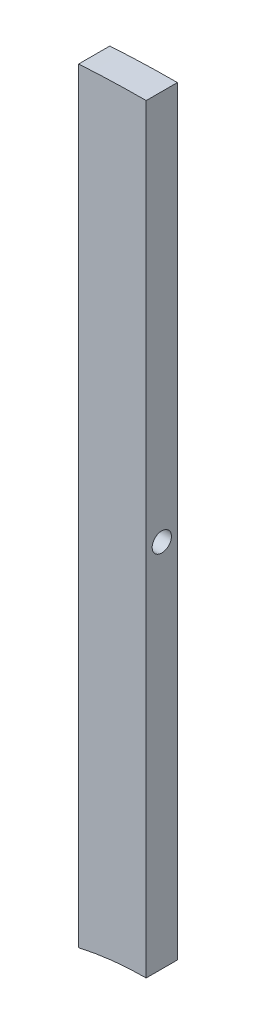
ISO-10303-21;
HEADER;
FILE_DESCRIPTION(('STEP AP214'),'2;1');
FILE_NAME('part.step','',(''),(''),'','','');
FILE_SCHEMA(('AUTOMOTIVE_DESIGN { 1 0 10303 214 1 1 1 1 }'));
ENDSEC;
DATA;
#1=APPLICATION_CONTEXT('core data for automotive mechanical design processes');
#2=APPLICATION_PROTOCOL_DEFINITION('international standard','automotive_design',2000,#1);
#3=PRODUCT_CONTEXT('',#1,'mechanical');
#4=PRODUCT('Part','Part','',(#3));
#5=PRODUCT_RELATED_PRODUCT_CATEGORY('part','',(#4));
#6=PRODUCT_DEFINITION_FORMATION('','',#4);
#7=PRODUCT_DEFINITION_CONTEXT('part definition',#1,'design');
#8=PRODUCT_DEFINITION('design','',#6,#7);
#9=PRODUCT_DEFINITION_SHAPE('','',#8);
#10=(LENGTH_UNIT() NAMED_UNIT(*) SI_UNIT(.MILLI.,.METRE.));
#11=(NAMED_UNIT(*) PLANE_ANGLE_UNIT() SI_UNIT($,.RADIAN.));
#12=(NAMED_UNIT(*) SI_UNIT($,.STERADIAN.) SOLID_ANGLE_UNIT());
#13=UNCERTAINTY_MEASURE_WITH_UNIT(LENGTH_MEASURE(1.E-05),#10,'distance_accuracy_value','');
#14=(GEOMETRIC_REPRESENTATION_CONTEXT(3) GLOBAL_UNCERTAINTY_ASSIGNED_CONTEXT((#13)) GLOBAL_UNIT_ASSIGNED_CONTEXT((#10,
#11,#12)) REPRESENTATION_CONTEXT('',''));
#15=CARTESIAN_POINT('',(0.,0.,0.));
#16=DIRECTION('',(0.,0.,1.));
#17=DIRECTION('',(1.,0.,0.));
#18=AXIS2_PLACEMENT_3D('',#15,#16,#17);
#19=CARTESIAN_POINT('',(0.,2.5,2.30625));
#20=DIRECTION('',(-1.,0.,0.));
#21=DIRECTION('',(0.,0.,1.));
#22=AXIS2_PLACEMENT_3D('',#19,#20,#21);
#23=PLANE('',#22);
#24=CARTESIAN_POINT('',(0.,0.,0.));
#25=DIRECTION('',(1.,0.,0.));
#26=DIRECTION('',(0.,0.,-1.));
#27=AXIS2_PLACEMENT_3D('',#24,#25,#26);
#28=CIRCLE('',#27,1.4224);
#29=CARTESIAN_POINT('',(0.,0.,-1.4224));
#30=VERTEX_POINT('',#29);
#31=EDGE_CURVE('E97',#30,#30,#28,.T.);
#32=ORIENTED_EDGE('',*,*,#31,.F.);
#33=EDGE_LOOP('',(#32));
#34=FACE_BOUND('',#33,.T.);
#35=DIRECTION('',(0.,1.,0.));
#36=VECTOR('',#35,1.);
#37=CARTESIAN_POINT('',(0.,2.5,-2.30625));
#38=LINE('',#37,#36);
#39=CARTESIAN_POINT('',(0.,-54.725,-2.30625));
#40=VERTEX_POINT('',#39);
#41=CARTESIAN_POINT('',(0.,57.6999999999999,-2.30625));
#42=VERTEX_POINT('',#41);
#43=EDGE_CURVE('E71',#40,#42,#38,.T.);
#44=ORIENTED_EDGE('',*,*,#43,.T.);
#45=DIRECTION('',(0.,0.,-1.));
#46=VECTOR('',#45,1.);
#47=CARTESIAN_POINT('',(0.,57.6999999999999,58.4047348280236));
#48=LINE('',#47,#46);
#49=CARTESIAN_POINT('',(0.,57.6999999999999,2.30625));
#50=VERTEX_POINT('',#49);
#51=EDGE_CURVE('E98',#50,#42,#48,.T.);
#52=ORIENTED_EDGE('',*,*,#51,.F.);
#53=DIRECTION('',(0.,1.,0.));
#54=VECTOR('',#53,1.);
#55=CARTESIAN_POINT('',(0.,2.5,2.30625));
#56=LINE('',#55,#54);
#57=CARTESIAN_POINT('',(0.,-54.725,2.30625));
#58=VERTEX_POINT('',#57);
#59=EDGE_CURVE('E39',#58,#50,#56,.T.);
#60=ORIENTED_EDGE('',*,*,#59,.F.);
#61=DIRECTION('',(0.,0.,-1.));
#62=VECTOR('',#61,1.);
#63=CARTESIAN_POINT('',(0.,-54.725,58.4047348280236));
#64=LINE('',#63,#62);
#65=EDGE_CURVE('E83',#58,#40,#64,.T.);
#66=ORIENTED_EDGE('',*,*,#65,.T.);
#67=EDGE_LOOP('',(#44,#52,#60,#66));
#68=FACE_BOUND('',#67,.T.);
#69=ADVANCED_FACE('F31',(#34,#68),#23,.F.);
#70=CARTESIAN_POINT('',(-10.,2.5,2.30625));
#71=DIRECTION('',(1.,0.,0.));
#72=DIRECTION('',(0.,0.,-1.));
#73=AXIS2_PLACEMENT_3D('',#70,#71,#72);
#74=PLANE('',#73);
#75=CARTESIAN_POINT('',(-10.,0.,0.));
#76=DIRECTION('',(1.,0.,0.));
#77=DIRECTION('',(0.,0.,-1.));
#78=AXIS2_PLACEMENT_3D('',#75,#76,#77);
#79=CIRCLE('',#78,1.4224);
#80=CARTESIAN_POINT('',(-10.,0.,-1.4224));
#81=VERTEX_POINT('',#80);
#82=EDGE_CURVE('E81',#81,#81,#79,.T.);
#83=ORIENTED_EDGE('',*,*,#82,.T.);
#84=EDGE_LOOP('',(#83));
#85=FACE_BOUND('',#84,.T.);
#86=DIRECTION('',(0.,-1.,0.));
#87=VECTOR('',#86,1.);
#88=CARTESIAN_POINT('',(-10.,2.5,-2.30625));
#89=LINE('',#88,#87);
#90=CARTESIAN_POINT('',(-9.99999999999999,57.3826229289625,-2.30625));
#91=VERTEX_POINT('',#90);
#92=CARTESIAN_POINT('',(-10.,-55.8431701205805,-2.30625));
#93=VERTEX_POINT('',#92);
#94=EDGE_CURVE('E34',#91,#93,#89,.T.);
#95=ORIENTED_EDGE('',*,*,#94,.T.);
#96=DIRECTION('',(0.,0.,-1.));
#97=VECTOR('',#96,1.);
#98=CARTESIAN_POINT('',(-10.,-55.8431701205805,58.4047348280236));
#99=LINE('',#98,#97);
#100=CARTESIAN_POINT('',(-10.,-55.8431701205805,2.30625));
#101=VERTEX_POINT('',#100);
#102=EDGE_CURVE('E86',#101,#93,#99,.T.);
#103=ORIENTED_EDGE('',*,*,#102,.F.);
#104=DIRECTION('',(0.,-1.,0.));
#105=VECTOR('',#104,1.);
#106=CARTESIAN_POINT('',(-10.,2.5,2.30625));
#107=LINE('',#106,#105);
#108=CARTESIAN_POINT('',(-9.99999999999999,57.3826229289625,2.30625000000002));
#109=VERTEX_POINT('',#108);
#110=EDGE_CURVE('E11',#109,#101,#107,.T.);
#111=ORIENTED_EDGE('',*,*,#110,.F.);
#112=DIRECTION('',(0.,0.,-1.));
#113=VECTOR('',#112,1.);
#114=CARTESIAN_POINT('',(-9.99999999999999,57.3826229289625,58.4047348280236));
#115=LINE('',#114,#113);
#116=EDGE_CURVE('E100',#109,#91,#115,.T.);
#117=ORIENTED_EDGE('',*,*,#116,.T.);
#118=EDGE_LOOP('',(#95,#103,#111,#117));
#119=FACE_BOUND('',#118,.T.);
#120=ADVANCED_FACE('F107',(#85,#119),#74,.F.);
#121=CARTESIAN_POINT('',(0.,-2.5,2.30625));
#122=DIRECTION('',(0.,0.,-1.));
#123=DIRECTION('',(-1.,0.,0.));
#124=AXIS2_PLACEMENT_3D('',#121,#122,#123);
#125=PLANE('',#124);
#126=ORIENTED_EDGE('',*,*,#59,.T.);
#127=CARTESIAN_POINT('',(0.,-100.,2.30625));
#128=DIRECTION('',(0.,0.,-1.));
#129=DIRECTION('',(-1.,0.,0.));
#130=AXIS2_PLACEMENT_3D('',#127,#128,#129);
#131=CIRCLE('',#130,157.7);
#132=EDGE_CURVE('E95',#50,#109,#131,.F.);
#133=ORIENTED_EDGE('',*,*,#132,.T.);
#134=ORIENTED_EDGE('',*,*,#110,.T.);
#135=CARTESIAN_POINT('',(0.,-100.,2.30625));
#136=DIRECTION('',(0.,0.,-1.));
#137=DIRECTION('',(-1.,0.,0.));
#138=AXIS2_PLACEMENT_3D('',#135,#136,#137);
#139=CIRCLE('',#138,45.275);
#140=EDGE_CURVE('E93',#101,#58,#139,.T.);
#141=ORIENTED_EDGE('',*,*,#140,.T.);
#142=EDGE_LOOP('',(#126,#133,#134,#141));
#143=FACE_BOUND('',#142,.T.);
#144=ADVANCED_FACE('F111',(#143),#125,.F.);
#145=CARTESIAN_POINT('',(0.,-2.5,-2.30625));
#146=DIRECTION('',(0.,0.,-1.));
#147=DIRECTION('',(-1.,0.,0.));
#148=AXIS2_PLACEMENT_3D('',#145,#146,#147);
#149=PLANE('',#148);
#150=ORIENTED_EDGE('',*,*,#43,.F.);
#151=CARTESIAN_POINT('',(0.,-100.,-2.30625));
#152=DIRECTION('',(0.,0.,1.));
#153=DIRECTION('',(1.,0.,0.));
#154=AXIS2_PLACEMENT_3D('',#151,#152,#153);
#155=CIRCLE('',#154,45.275);
#156=EDGE_CURVE('E75',#40,#93,#155,.T.);
#157=ORIENTED_EDGE('',*,*,#156,.T.);
#158=ORIENTED_EDGE('',*,*,#94,.F.);
#159=CARTESIAN_POINT('',(0.,-100.,-2.30625));
#160=DIRECTION('',(0.,0.,-1.));
#161=DIRECTION('',(1.,0.,0.));
#162=AXIS2_PLACEMENT_3D('',#159,#160,#161);
#163=CIRCLE('',#162,157.7);
#164=EDGE_CURVE('E77',#91,#42,#163,.T.);
#165=ORIENTED_EDGE('',*,*,#164,.T.);
#166=EDGE_LOOP('',(#150,#157,#158,#165));
#167=FACE_BOUND('',#166,.T.);
#168=ADVANCED_FACE('F73',(#167),#149,.T.);
#169=CARTESIAN_POINT('',(-10.,0.,0.));
#170=DIRECTION('',(1.,0.,0.));
#171=DIRECTION('',(0.,0.,-1.));
#172=AXIS2_PLACEMENT_3D('',#169,#170,#171);
#173=CYLINDRICAL_SURFACE('',#172,1.4224);
#174=ORIENTED_EDGE('',*,*,#82,.F.);
#175=EDGE_LOOP('',(#174));
#176=FACE_BOUND('',#175,.T.);
#177=ORIENTED_EDGE('',*,*,#31,.T.);
#178=EDGE_LOOP('',(#177));
#179=FACE_BOUND('',#178,.T.);
#180=ADVANCED_FACE('F118',(#176,#179),#173,.F.);
#181=CARTESIAN_POINT('',(0.,-100.,58.4047348280236));
#182=DIRECTION('',(0.,0.,-1.));
#183=DIRECTION('',(-1.,0.,0.));
#184=AXIS2_PLACEMENT_3D('',#181,#182,#183);
#185=CYLINDRICAL_SURFACE('',#184,157.7);
#186=ORIENTED_EDGE('',*,*,#132,.F.);
#187=ORIENTED_EDGE('',*,*,#51,.T.);
#188=ORIENTED_EDGE('',*,*,#164,.F.);
#189=ORIENTED_EDGE('',*,*,#116,.F.);
#190=EDGE_LOOP('',(#186,#187,#188,#189));
#191=FACE_BOUND('',#190,.T.);
#192=ADVANCED_FACE('F110',(#191),#185,.T.);
#193=CARTESIAN_POINT('',(0.,-100.,58.4047348280236));
#194=DIRECTION('',(0.,0.,-1.));
#195=DIRECTION('',(-1.,0.,0.));
#196=AXIS2_PLACEMENT_3D('',#193,#194,#195);
#197=CYLINDRICAL_SURFACE('',#196,45.275);
#198=ORIENTED_EDGE('',*,*,#140,.F.);
#199=ORIENTED_EDGE('',*,*,#102,.T.);
#200=ORIENTED_EDGE('',*,*,#156,.F.);
#201=ORIENTED_EDGE('',*,*,#65,.F.);
#202=EDGE_LOOP('',(#198,#199,#200,#201));
#203=FACE_BOUND('',#202,.T.);
#204=ADVANCED_FACE('F89',(#203),#197,.F.);
#205=CLOSED_SHELL('',(#69,#120,#144,#168,#180,#192,#204));
#206=MANIFOLD_SOLID_BREP('B2',#205);
#207=ADVANCED_BREP_SHAPE_REPRESENTATION('',(#18,#206),#14);
#208=SHAPE_DEFINITION_REPRESENTATION(#9,#207);
ENDSEC;
END-ISO-10303-21;
